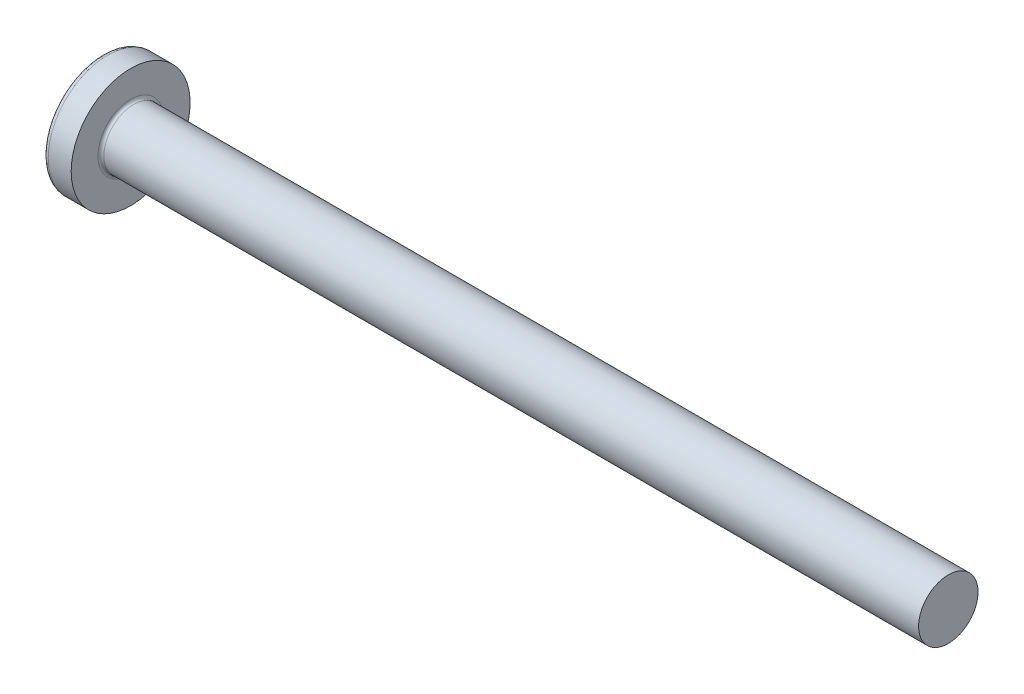
ISO-10303-21;
HEADER;
FILE_DESCRIPTION(('STEP AP214'),'2;1');
FILE_NAME('part.step','',(''),(''),'','','');
FILE_SCHEMA(('AUTOMOTIVE_DESIGN { 1 0 10303 214 1 1 1 1 }'));
ENDSEC;
DATA;
#1=APPLICATION_CONTEXT('core data for automotive mechanical design processes');
#2=APPLICATION_PROTOCOL_DEFINITION('international standard','automotive_design',2000,#1);
#3=PRODUCT_CONTEXT('',#1,'mechanical');
#4=PRODUCT('Part','Part','',(#3));
#5=PRODUCT_RELATED_PRODUCT_CATEGORY('part','',(#4));
#6=PRODUCT_DEFINITION_FORMATION('','',#4);
#7=PRODUCT_DEFINITION_CONTEXT('part definition',#1,'design');
#8=PRODUCT_DEFINITION('design','',#6,#7);
#9=PRODUCT_DEFINITION_SHAPE('','',#8);
#10=(LENGTH_UNIT() NAMED_UNIT(*) SI_UNIT(.MILLI.,.METRE.));
#11=(NAMED_UNIT(*) PLANE_ANGLE_UNIT() SI_UNIT($,.RADIAN.));
#12=(NAMED_UNIT(*) SI_UNIT($,.STERADIAN.) SOLID_ANGLE_UNIT());
#13=UNCERTAINTY_MEASURE_WITH_UNIT(LENGTH_MEASURE(1.E-05),#10,'distance_accuracy_value','');
#14=(GEOMETRIC_REPRESENTATION_CONTEXT(3) GLOBAL_UNCERTAINTY_ASSIGNED_CONTEXT((#13)) GLOBAL_UNIT_ASSIGNED_CONTEXT((#10,
#11,#12)) REPRESENTATION_CONTEXT('',''));
#15=CARTESIAN_POINT('',(0.,0.,0.));
#16=DIRECTION('',(0.,0.,1.));
#17=DIRECTION('',(1.,0.,0.));
#18=AXIS2_PLACEMENT_3D('',#15,#16,#17);
#19=CARTESIAN_POINT('',(6.5,0.,0.));
#20=DIRECTION('',(-1.,0.,0.));
#21=DIRECTION('',(0.,1.,0.));
#22=AXIS2_PLACEMENT_3D('',#19,#20,#21);
#23=SPHERICAL_SURFACE('',#22,6.5);
#24=CARTESIAN_POINT('',(1.26538895452803,0.,0.));
#25=DIRECTION('',(-1.,0.,0.));
#26=DIRECTION('',(0.,0.,1.));
#27=AXIS2_PLACEMENT_3D('',#24,#25,#26);
#28=CIRCLE('',#27,3.85342019543974);
#29=CARTESIAN_POINT('',(1.26538895452803,0.,3.85342019543974));
#30=VERTEX_POINT('',#29);
#31=EDGE_CURVE('E222',#30,#30,#28,.T.);
#32=ORIENTED_EDGE('',*,*,#31,.T.);
#33=EDGE_LOOP('',(#32));
#34=FACE_BOUND('',#33,.T.);
#35=CARTESIAN_POINT('',(0.0788099820016241,0.,0.));
#36=DIRECTION('',(1.,0.,0.));
#37=DIRECTION('',(0.,0.,-1.));
#38=AXIS2_PLACEMENT_3D('',#35,#36,#37);
#39=CIRCLE('',#38,1.0091178091571);
#40=CARTESIAN_POINT('',(0.0788099820016233,-0.514999999999997,-0.867809744562728));
#41=VERTEX_POINT('',#40);
#42=CARTESIAN_POINT('',(0.0788099820016245,-0.867809744562729,-0.515));
#43=VERTEX_POINT('',#42);
#44=EDGE_CURVE('E381',#41,#43,#39,.F.);
#45=ORIENTED_EDGE('',*,*,#44,.F.);
#46=CARTESIAN_POINT('',(6.5,-0.515,0.));
#47=DIRECTION('',(0.,1.,0.));
#48=DIRECTION('',(0.,0.,1.));
#49=AXIS2_PLACEMENT_3D('',#46,#47,#48);
#50=CIRCLE('',#49,6.47956595768575);
#51=CARTESIAN_POINT('',(0.331830520157853,-0.514999999999993,-1.98455543332603));
#52=VERTEX_POINT('',#51);
#53=EDGE_CURVE('E297',#52,#41,#50,.T.);
#54=ORIENTED_EDGE('',*,*,#53,.F.);
#55=CARTESIAN_POINT('',(6.06443225879603,0.,0.873613881878153));
#56=DIRECTION('',(0.446197753347436,0.,-0.894934391398443));
#57=DIRECTION('',(-0.894934391398442,0.,-0.446197753347436));
#58=AXIS2_PLACEMENT_3D('',#55,#56,#57);
#59=CIRCLE('',#58,6.42628038045433);
#60=CARTESIAN_POINT('',(0.331830520157853,0.515000000000007,-1.98455543332603));
#61=VERTEX_POINT('',#60);
#62=EDGE_CURVE('E266',#52,#61,#59,.T.);
#63=ORIENTED_EDGE('',*,*,#62,.T.);
#64=CARTESIAN_POINT('',(6.5,0.515,0.));
#65=DIRECTION('',(0.,-1.,0.));
#66=DIRECTION('',(0.,0.,-1.));
#67=AXIS2_PLACEMENT_3D('',#64,#65,#66);
#68=CIRCLE('',#67,6.47956595768575);
#69=CARTESIAN_POINT('',(0.0788099820016234,0.515000000000003,-0.867809744562724));
#70=VERTEX_POINT('',#69);
#71=EDGE_CURVE('E333',#70,#61,#68,.T.);
#72=ORIENTED_EDGE('',*,*,#71,.F.);
#73=CARTESIAN_POINT('',(0.0788099820016245,0.86780974456273,-0.515));
#74=VERTEX_POINT('',#73);
#75=EDGE_CURVE('E402',#74,#70,#39,.F.);
#76=ORIENTED_EDGE('',*,*,#75,.F.);
#77=CARTESIAN_POINT('',(6.5,0.,-0.515));
#78=DIRECTION('',(0.,0.,1.));
#79=DIRECTION('',(1.,0.,0.));
#80=AXIS2_PLACEMENT_3D('',#77,#78,#79);
#81=CIRCLE('',#80,6.47956595768575);
#82=CARTESIAN_POINT('',(0.331830520157854,1.98455543332603,-0.515));
#83=VERTEX_POINT('',#82);
#84=EDGE_CURVE('E258',#83,#74,#81,.T.);
#85=ORIENTED_EDGE('',*,*,#84,.F.);
#86=CARTESIAN_POINT('',(6.06443225879603,-0.873613881878153,0.));
#87=DIRECTION('',(0.446197753347436,0.894934391398443,0.));
#88=DIRECTION('',(-0.894934391398442,0.446197753347436,0.));
#89=AXIS2_PLACEMENT_3D('',#86,#87,#88);
#90=CIRCLE('',#89,6.42628038045433);
#91=CARTESIAN_POINT('',(0.331830520157854,1.98455543332603,0.515));
#92=VERTEX_POINT('',#91);
#93=EDGE_CURVE('E262',#83,#92,#90,.T.);
#94=ORIENTED_EDGE('',*,*,#93,.T.);
#95=CARTESIAN_POINT('',(6.5,0.,0.515));
#96=DIRECTION('',(0.,0.,-1.));
#97=DIRECTION('',(0.,1.,0.));
#98=AXIS2_PLACEMENT_3D('',#95,#96,#97);
#99=CIRCLE('',#98,6.47956595768575);
#100=CARTESIAN_POINT('',(0.0788099820016245,0.86780974456273,0.515));
#101=VERTEX_POINT('',#100);
#102=EDGE_CURVE('E253',#101,#92,#99,.T.);
#103=ORIENTED_EDGE('',*,*,#102,.F.);
#104=CARTESIAN_POINT('',(0.0788099820016232,0.514999999999997,0.867809744562728));
#105=VERTEX_POINT('',#104);
#106=EDGE_CURVE('E401',#105,#101,#39,.F.);
#107=ORIENTED_EDGE('',*,*,#106,.F.);
#108=CARTESIAN_POINT('',(0.331830520157854,0.514999999999993,1.98455543332604));
#109=VERTEX_POINT('',#108);
#110=EDGE_CURVE('E278',#109,#105,#68,.T.);
#111=ORIENTED_EDGE('',*,*,#110,.F.);
#112=CARTESIAN_POINT('',(6.06443225879603,0.,-0.873613881878153));
#113=DIRECTION('',(0.446197753347436,0.,0.894934391398443));
#114=DIRECTION('',(0.894934391398442,0.,-0.446197753347436));
#115=AXIS2_PLACEMENT_3D('',#112,#113,#114);
#116=CIRCLE('',#115,6.42628038045433);
#117=CARTESIAN_POINT('',(0.331830520157854,-0.515000000000007,1.98455543332603));
#118=VERTEX_POINT('',#117);
#119=EDGE_CURVE('E56',#109,#118,#116,.T.);
#120=ORIENTED_EDGE('',*,*,#119,.T.);
#121=CARTESIAN_POINT('',(0.0788099820016234,-0.515000000000003,0.867809744562724));
#122=VERTEX_POINT('',#121);
#123=EDGE_CURVE('E275',#122,#118,#50,.T.);
#124=ORIENTED_EDGE('',*,*,#123,.F.);
#125=CARTESIAN_POINT('',(0.0788099820016245,-0.867809744562729,0.515));
#126=VERTEX_POINT('',#125);
#127=EDGE_CURVE('E440',#126,#122,#39,.F.);
#128=ORIENTED_EDGE('',*,*,#127,.F.);
#129=CARTESIAN_POINT('',(0.331830520157854,-1.98455543332603,0.515));
#130=VERTEX_POINT('',#129);
#131=EDGE_CURVE('E254',#130,#126,#99,.T.);
#132=ORIENTED_EDGE('',*,*,#131,.F.);
#133=CARTESIAN_POINT('',(6.06443225879604,0.873613881878153,0.));
#134=DIRECTION('',(0.446197753347436,-0.894934391398443,0.));
#135=DIRECTION('',(0.894934391398442,0.446197753347436,0.));
#136=AXIS2_PLACEMENT_3D('',#133,#134,#135);
#137=CIRCLE('',#136,6.42628038045433);
#138=CARTESIAN_POINT('',(0.331830520157854,-1.98455543332603,-0.515));
#139=VERTEX_POINT('',#138);
#140=EDGE_CURVE('E249',#130,#139,#137,.T.);
#141=ORIENTED_EDGE('',*,*,#140,.T.);
#142=EDGE_CURVE('E71',#43,#139,#81,.T.);
#143=ORIENTED_EDGE('',*,*,#142,.F.);
#144=EDGE_LOOP('',(#45,#54,#63,#72,#76,#85,#94,#103,#107,#111,#120,#124,#128,#132,#141,#143));
#145=FACE_BOUND('',#144,.T.);
#146=ADVANCED_FACE('F41',(#34,#145),#23,.T.);
#147=CARTESIAN_POINT('',(0.,2.15,-0.515));
#148=DIRECTION('',(0.,0.,1.));
#149=DIRECTION('',(1.,0.,0.));
#150=AXIS2_PLACEMENT_3D('',#147,#148,#149);
#151=PLANE('',#150);
#152=ORIENTED_EDGE('',*,*,#84,.T.);
#153=CARTESIAN_POINT('',(-1.51195208675156,0.994972220320188,-0.515));
#154=CARTESIAN_POINT('',(-1.2040598194928,0.970722016949958,-0.515));
#155=CARTESIAN_POINT('',(-0.896180907521175,0.946299109919651,-0.515));
#156=CARTESIAN_POINT('',(-0.280449079832186,0.896981122427851,-0.515));
#157=CARTESIAN_POINT('',(0.0274038344396859,0.872086023934883,-0.515));
#158=CARTESIAN_POINT('',(0.48914673951535,0.83429553519528,-0.515));
#159=CARTESIAN_POINT('',(0.643055047553845,0.821624058404092,-0.515));
#160=CARTESIAN_POINT('',(0.950856520197139,0.796108332639504,-0.515));
#161=CARTESIAN_POINT('',(1.10474968487868,0.783264084592466,-0.515));
#162=CARTESIAN_POINT('',(1.41251352095103,0.757376569093378,-0.515));
#163=CARTESIAN_POINT('',(1.56638419296577,0.744333309065218,-0.515));
#164=CARTESIAN_POINT('',(1.87410847343335,0.718013273188896,-0.515));
#165=CARTESIAN_POINT('',(2.02796208151372,0.704736492982792,-0.515));
#166=CARTESIAN_POINT('',(2.36455311890989,0.675386943006726,-0.515));
#167=CARTESIAN_POINT('',(2.54728562293342,0.659257575640986,-0.515));
#168=CARTESIAN_POINT('',(2.91270624109256,0.626517182479888,-0.515));
#169=CARTESIAN_POINT('',(3.09539435554038,0.609906160177238,-0.515));
#170=CARTESIAN_POINT('',(3.46069832191613,0.576073027116421,-0.515));
#171=CARTESIAN_POINT('',(3.64331417870068,0.558850968932727,-0.515));
#172=CARTESIAN_POINT('',(4.00847437496567,0.523604864540037,-0.515));
#173=CARTESIAN_POINT('',(4.19101871216888,0.505580794604253,-0.515));
#174=CARTESIAN_POINT('',(4.55606208157937,0.468429191666488,-0.515));
#175=CARTESIAN_POINT('',(4.73856107358023,0.449301262281853,-0.515));
#176=CARTESIAN_POINT('',(5.10337547353419,0.409473604748924,-0.515));
#177=CARTESIAN_POINT('',(5.28569089526422,0.388774005106069,-0.515));
#178=CARTESIAN_POINT('',(5.55897278495412,0.355828287527264,-0.515));
#179=CARTESIAN_POINT('',(5.65005277419686,0.344527918782738,-0.515));
#180=CARTESIAN_POINT('',(5.83209904103608,0.321075174263031,-0.515));
#181=CARTESIAN_POINT('',(5.92306532397915,0.308922840209686,-0.515));
#182=CARTESIAN_POINT('',(6.10486078872898,0.28342733445193,-0.515));
#183=CARTESIAN_POINT('',(6.1956899229938,0.270083817601714,-0.515));
#184=CARTESIAN_POINT('',(6.33172773785679,0.248701420809951,-0.515));
#185=CARTESIAN_POINT('',(6.37704304473344,0.241345446705304,-0.515));
#186=CARTESIAN_POINT('',(6.4675722520141,0.226018953559338,-0.515));
#187=CARTESIAN_POINT('',(6.51278614568083,0.218048394864476,-0.515));
#188=CARTESIAN_POINT('',(6.55793125759549,0.209691465274944,-0.515));
#189=B_SPLINE_CURVE_WITH_KNOTS('',3,(#153,#154,#155,#156,#157,#158,#159,#160,#161,#162,#163,
#164,#165,#166,#167,#168,#169,#170,#171,#172,#173,#174,#175,#176,#177,#178,#179,#180,#181,#182,
#183,#184,#185,#186,#187,#188),.UNSPECIFIED.,.F.,.F.,(4,2,2,2,2,2,2,2,2,2,2,2,2,2,2,2,2,4),(0.,
0.926537709781721,1.85311087258339,2.31639796016285,2.77968256468771,3.24294992902055,
3.70622594801777,4.25655436065378,4.80687878359543,5.35715597005738,5.90744944680718,
6.45794177197673,7.008389135274,7.28372117336899,7.55903973750591,7.83443833587749,
7.97216007460855,8.10989070671571),.UNSPECIFIED.);
#190=CARTESIAN_POINT('',(2.34,0.677477674908923,-0.515));
#191=VERTEX_POINT('',#190);
#192=EDGE_CURVE('E425',#74,#191,#189,.T.);
#193=ORIENTED_EDGE('',*,*,#192,.T.);
#194=DIRECTION('',(0.,1.,0.));
#195=VECTOR('',#194,1.);
#196=CARTESIAN_POINT('',(2.34,-0.983319232260742,-0.515));
#197=LINE('',#196,#195);
#198=CARTESIAN_POINT('',(2.34,0.983319232260743,-0.515));
#199=VERTEX_POINT('',#198);
#200=EDGE_CURVE('E362',#191,#199,#197,.T.);
#201=ORIENTED_EDGE('',*,*,#200,.T.);
#202=DIRECTION('',(0.894934391398442,-0.446197753347436,0.));
#203=VECTOR('',#202,1.);
#204=CARTESIAN_POINT('',(0.,2.15,-0.515));
#205=LINE('',#204,#203);
#206=EDGE_CURVE('E223',#83,#199,#205,.T.);
#207=ORIENTED_EDGE('',*,*,#206,.F.);
#208=EDGE_LOOP('',(#152,#193,#201,#207));
#209=FACE_BOUND('',#208,.T.);
#210=ADVANCED_FACE('F177',(#209),#151,.T.);
#211=CARTESIAN_POINT('',(2.34,-0.983319232260742,-0.515));
#212=VERTEX_POINT('',#211);
#213=CARTESIAN_POINT('',(2.34,-0.677477674908923,-0.515));
#214=VERTEX_POINT('',#213);
#215=EDGE_CURVE('E233',#212,#214,#197,.T.);
#216=ORIENTED_EDGE('',*,*,#215,.T.);
#217=CARTESIAN_POINT('',(-1.51195208675156,-0.994972220320188,-0.515));
#218=CARTESIAN_POINT('',(-1.2040598194928,-0.970722016949958,-0.515));
#219=CARTESIAN_POINT('',(-0.896180907521175,-0.946299109919651,-0.515));
#220=CARTESIAN_POINT('',(-0.280449079832186,-0.896981122427851,-0.515));
#221=CARTESIAN_POINT('',(0.0274038344396859,-0.872086023934883,-0.515));
#222=CARTESIAN_POINT('',(0.489146739515349,-0.83429553519528,-0.515));
#223=CARTESIAN_POINT('',(0.643055047553845,-0.821624058404092,-0.515));
#224=CARTESIAN_POINT('',(0.950856520197139,-0.796108332639504,-0.515));
#225=CARTESIAN_POINT('',(1.10474968487868,-0.783264084592466,-0.515));
#226=CARTESIAN_POINT('',(1.41251352095103,-0.757376569093378,-0.515));
#227=CARTESIAN_POINT('',(1.56638419296577,-0.744333309065218,-0.515));
#228=CARTESIAN_POINT('',(1.87410847343335,-0.718013273188896,-0.515));
#229=CARTESIAN_POINT('',(2.02796208151372,-0.704736492982792,-0.515));
#230=CARTESIAN_POINT('',(2.36455311890989,-0.675386943006726,-0.515));
#231=CARTESIAN_POINT('',(2.54728562293342,-0.659257575640986,-0.515));
#232=CARTESIAN_POINT('',(2.91270624109256,-0.626517182479888,-0.515));
#233=CARTESIAN_POINT('',(3.09539435554038,-0.609906160177238,-0.515));
#234=CARTESIAN_POINT('',(3.46069832191613,-0.576073027116421,-0.515));
#235=CARTESIAN_POINT('',(3.64331417870068,-0.558850968932727,-0.515));
#236=CARTESIAN_POINT('',(4.00847437496567,-0.523604864540037,-0.515));
#237=CARTESIAN_POINT('',(4.19101871216888,-0.505580794604253,-0.515));
#238=CARTESIAN_POINT('',(4.55606208157937,-0.468429191666488,-0.515));
#239=CARTESIAN_POINT('',(4.73856107358023,-0.449301262281853,-0.515));
#240=CARTESIAN_POINT('',(5.10337547353419,-0.409473604748924,-0.515));
#241=CARTESIAN_POINT('',(5.28569089526422,-0.388774005106069,-0.515));
#242=CARTESIAN_POINT('',(5.55897278495412,-0.355828287527264,-0.515));
#243=CARTESIAN_POINT('',(5.65005277419686,-0.344527918782738,-0.515));
#244=CARTESIAN_POINT('',(5.83209904103608,-0.321075174263031,-0.515));
#245=CARTESIAN_POINT('',(5.92306532397915,-0.308922840209686,-0.515));
#246=CARTESIAN_POINT('',(6.10486078872898,-0.28342733445193,-0.515));
#247=CARTESIAN_POINT('',(6.1956899229938,-0.270083817601714,-0.515));
#248=CARTESIAN_POINT('',(6.3317277378568,-0.24870142080995,-0.515));
#249=CARTESIAN_POINT('',(6.37704304473344,-0.241345446705304,-0.515));
#250=CARTESIAN_POINT('',(6.4675722520141,-0.226018953559337,-0.515));
#251=CARTESIAN_POINT('',(6.51278614568083,-0.218048394864476,-0.515));
#252=CARTESIAN_POINT('',(6.55793125759549,-0.209691465274944,-0.515));
#253=B_SPLINE_CURVE_WITH_KNOTS('',3,(#217,#218,#219,#220,#221,#222,#223,#224,#225,#226,#227,
#228,#229,#230,#231,#232,#233,#234,#235,#236,#237,#238,#239,#240,#241,#242,#243,#244,#245,#246,
#247,#248,#249,#250,#251,#252),.UNSPECIFIED.,.F.,.F.,(4,2,2,2,2,2,2,2,2,2,2,2,2,2,2,2,2,4),(0.,
0.926537709781721,1.85311087258339,2.31639796016285,2.77968256468771,3.24294992902055,
3.70622594801777,4.25655436065378,4.80687878359543,5.35715597005738,5.90744944680718,
6.45794177197674,7.008389135274,7.28372117336899,7.55903973750591,7.83443833587749,
7.97216007460855,8.10989070671572),.UNSPECIFIED.);
#254=EDGE_CURVE('E400',#214,#43,#253,.F.);
#255=ORIENTED_EDGE('',*,*,#254,.T.);
#256=ORIENTED_EDGE('',*,*,#142,.T.);
#257=DIRECTION('',(0.894934391398442,0.446197753347436,0.));
#258=VECTOR('',#257,1.);
#259=CARTESIAN_POINT('',(0.,-2.15,-0.515));
#260=LINE('',#259,#258);
#261=EDGE_CURVE('E337',#139,#212,#260,.T.);
#262=ORIENTED_EDGE('',*,*,#261,.T.);
#263=EDGE_LOOP('',(#216,#255,#256,#262));
#264=FACE_BOUND('',#263,.T.);
#265=ADVANCED_FACE('F183',(#264),#151,.T.);
#266=CARTESIAN_POINT('',(0.,-2.15,0.515));
#267=DIRECTION('',(0.,0.,-1.));
#268=DIRECTION('',(0.,1.,0.));
#269=AXIS2_PLACEMENT_3D('',#266,#267,#268);
#270=PLANE('',#269);
#271=DIRECTION('',(0.,-1.,0.));
#272=VECTOR('',#271,1.);
#273=CARTESIAN_POINT('',(2.34,0.983319232260742,0.515));
#274=LINE('',#273,#272);
#275=CARTESIAN_POINT('',(2.34,0.983319232260743,0.515));
#276=VERTEX_POINT('',#275);
#277=CARTESIAN_POINT('',(2.34,0.677477674908923,0.515));
#278=VERTEX_POINT('',#277);
#279=EDGE_CURVE('E348',#276,#278,#274,.T.);
#280=ORIENTED_EDGE('',*,*,#279,.T.);
#281=CARTESIAN_POINT('',(-1.51195208675156,0.994972220320187,0.515));
#282=CARTESIAN_POINT('',(-1.2040598194928,0.970722016949958,0.515));
#283=CARTESIAN_POINT('',(-0.896180907521175,0.946299109919651,0.515));
#284=CARTESIAN_POINT('',(-0.280449079832187,0.896981122427851,0.515));
#285=CARTESIAN_POINT('',(0.0274038344396859,0.872086023934883,0.515));
#286=CARTESIAN_POINT('',(0.489146739515349,0.83429553519528,0.515));
#287=CARTESIAN_POINT('',(0.643055047553845,0.821624058404092,0.515));
#288=CARTESIAN_POINT('',(0.950856520197139,0.796108332639504,0.515));
#289=CARTESIAN_POINT('',(1.10474968487868,0.783264084592466,0.515));
#290=CARTESIAN_POINT('',(1.41251352095103,0.757376569093378,0.515));
#291=CARTESIAN_POINT('',(1.56638419296577,0.744333309065218,0.515));
#292=CARTESIAN_POINT('',(1.87410847343335,0.718013273188896,0.515));
#293=CARTESIAN_POINT('',(2.02796208151372,0.704736492982792,0.515));
#294=CARTESIAN_POINT('',(2.36455311890989,0.675386943006726,0.515));
#295=CARTESIAN_POINT('',(2.54728562293342,0.659257575640986,0.515));
#296=CARTESIAN_POINT('',(2.91270624109256,0.626517182479888,0.515));
#297=CARTESIAN_POINT('',(3.09539435554038,0.609906160177238,0.515));
#298=CARTESIAN_POINT('',(3.46069832191612,0.576073027116421,0.515));
#299=CARTESIAN_POINT('',(3.64331417870068,0.558850968932727,0.515));
#300=CARTESIAN_POINT('',(4.00847437496567,0.523604864540037,0.515));
#301=CARTESIAN_POINT('',(4.19101871216888,0.505580794604253,0.515));
#302=CARTESIAN_POINT('',(4.55606208157937,0.468429191666488,0.515));
#303=CARTESIAN_POINT('',(4.73856107358022,0.449301262281854,0.515));
#304=CARTESIAN_POINT('',(5.10337547353418,0.409473604748925,0.515));
#305=CARTESIAN_POINT('',(5.28569089526422,0.38877400510607,0.515));
#306=CARTESIAN_POINT('',(5.55897278495412,0.355828287527264,0.515));
#307=CARTESIAN_POINT('',(5.65005277419686,0.344527918782739,0.515));
#308=CARTESIAN_POINT('',(5.83209904103607,0.321075174263031,0.515));
#309=CARTESIAN_POINT('',(5.92306532397915,0.308922840209686,0.515));
#310=CARTESIAN_POINT('',(6.10486078872898,0.28342733445193,0.515));
#311=CARTESIAN_POINT('',(6.1956899229938,0.270083817601714,0.515));
#312=CARTESIAN_POINT('',(6.33172773785679,0.248701420809951,0.515));
#313=CARTESIAN_POINT('',(6.37704304473344,0.241345446705304,0.515));
#314=CARTESIAN_POINT('',(6.4675722520141,0.226018953559338,0.515));
#315=CARTESIAN_POINT('',(6.51278614568083,0.218048394864476,0.515));
#316=CARTESIAN_POINT('',(6.55793125759549,0.209691465274945,0.515));
#317=B_SPLINE_CURVE_WITH_KNOTS('',3,(#281,#282,#283,#284,#285,#286,#287,#288,#289,#290,#291,
#292,#293,#294,#295,#296,#297,#298,#299,#300,#301,#302,#303,#304,#305,#306,#307,#308,#309,#310,
#311,#312,#313,#314,#315,#316),.UNSPECIFIED.,.F.,.F.,(4,2,2,2,2,2,2,2,2,2,2,2,2,2,2,2,2,4),(0.,
0.926537709781721,1.85311087258339,2.31639796016285,2.77968256468771,3.24294992902055,
3.70622594801777,4.25655436065378,4.80687878359543,5.35715597005738,5.90744944680718,
6.45794177197673,7.008389135274,7.28372117336899,7.55903973750591,7.83443833587749,
7.97216007460855,8.10989070671571),.UNSPECIFIED.);
#318=EDGE_CURVE('E302',#278,#101,#317,.F.);
#319=ORIENTED_EDGE('',*,*,#318,.T.);
#320=ORIENTED_EDGE('',*,*,#102,.T.);
#321=DIRECTION('',(0.894934391398442,-0.446197753347436,0.));
#322=VECTOR('',#321,1.);
#323=CARTESIAN_POINT('',(0.,2.15,0.515));
#324=LINE('',#323,#322);
#325=EDGE_CURVE('E230',#92,#276,#324,.T.);
#326=ORIENTED_EDGE('',*,*,#325,.T.);
#327=EDGE_LOOP('',(#280,#319,#320,#326));
#328=FACE_BOUND('',#327,.T.);
#329=ADVANCED_FACE('F421',(#328),#270,.T.);
#330=ORIENTED_EDGE('',*,*,#131,.T.);
#331=CARTESIAN_POINT('',(-1.51195208675156,-0.994972220320188,0.515));
#332=CARTESIAN_POINT('',(-1.2040598194928,-0.970722016949958,0.515));
#333=CARTESIAN_POINT('',(-0.896180907521175,-0.946299109919651,0.515));
#334=CARTESIAN_POINT('',(-0.280449079832186,-0.896981122427852,0.515));
#335=CARTESIAN_POINT('',(0.0274038344396859,-0.872086023934883,0.515));
#336=CARTESIAN_POINT('',(0.48914673951535,-0.83429553519528,0.515));
#337=CARTESIAN_POINT('',(0.643055047553845,-0.821624058404092,0.515));
#338=CARTESIAN_POINT('',(0.950856520197139,-0.796108332639504,0.515));
#339=CARTESIAN_POINT('',(1.10474968487868,-0.783264084592466,0.515));
#340=CARTESIAN_POINT('',(1.41251352095103,-0.757376569093379,0.515));
#341=CARTESIAN_POINT('',(1.56638419296577,-0.744333309065218,0.515));
#342=CARTESIAN_POINT('',(1.87410847343335,-0.718013273188896,0.515));
#343=CARTESIAN_POINT('',(2.02796208151372,-0.704736492982792,0.515));
#344=CARTESIAN_POINT('',(2.36455311890989,-0.675386943006726,0.515));
#345=CARTESIAN_POINT('',(2.54728562293342,-0.659257575640986,0.515));
#346=CARTESIAN_POINT('',(2.91270624109256,-0.626517182479888,0.515));
#347=CARTESIAN_POINT('',(3.09539435554038,-0.609906160177238,0.515));
#348=CARTESIAN_POINT('',(3.46069832191613,-0.576073027116422,0.515));
#349=CARTESIAN_POINT('',(3.64331417870068,-0.558850968932728,0.515));
#350=CARTESIAN_POINT('',(4.00847437496567,-0.523604864540037,0.515));
#351=CARTESIAN_POINT('',(4.19101871216888,-0.505580794604253,0.515));
#352=CARTESIAN_POINT('',(4.55606208157937,-0.468429191666488,0.515));
#353=CARTESIAN_POINT('',(4.73856107358023,-0.449301262281854,0.515));
#354=CARTESIAN_POINT('',(5.10337547353419,-0.409473604748924,0.515));
#355=CARTESIAN_POINT('',(5.28569089526422,-0.38877400510607,0.515));
#356=CARTESIAN_POINT('',(5.55897278495412,-0.355828287527264,0.515));
#357=CARTESIAN_POINT('',(5.65005277419686,-0.344527918782739,0.515));
#358=CARTESIAN_POINT('',(5.83209904103608,-0.321075174263031,0.515));
#359=CARTESIAN_POINT('',(5.92306532397915,-0.308922840209686,0.515));
#360=CARTESIAN_POINT('',(6.10486078872898,-0.28342733445193,0.515));
#361=CARTESIAN_POINT('',(6.1956899229938,-0.270083817601714,0.515));
#362=CARTESIAN_POINT('',(6.33172773785679,-0.248701420809951,0.515));
#363=CARTESIAN_POINT('',(6.37704304473344,-0.241345446705304,0.515));
#364=CARTESIAN_POINT('',(6.4675722520141,-0.226018953559338,0.515));
#365=CARTESIAN_POINT('',(6.51278614568083,-0.218048394864477,0.515));
#366=CARTESIAN_POINT('',(6.55793125759549,-0.209691465274945,0.515));
#367=B_SPLINE_CURVE_WITH_KNOTS('',3,(#331,#332,#333,#334,#335,#336,#337,#338,#339,#340,#341,
#342,#343,#344,#345,#346,#347,#348,#349,#350,#351,#352,#353,#354,#355,#356,#357,#358,#359,#360,
#361,#362,#363,#364,#365,#366),.UNSPECIFIED.,.F.,.F.,(4,2,2,2,2,2,2,2,2,2,2,2,2,2,2,2,2,4),(0.,
0.926537709781721,1.85311087258339,2.31639796016285,2.77968256468771,3.24294992902055,
3.70622594801777,4.25655436065378,4.80687878359543,5.35715597005738,5.90744944680718,
6.45794177197673,7.008389135274,7.28372117336899,7.55903973750591,7.83443833587749,
7.97216007460855,8.10989070671571),.UNSPECIFIED.);
#368=CARTESIAN_POINT('',(2.34,-0.677477674908923,0.515));
#369=VERTEX_POINT('',#368);
#370=EDGE_CURVE('E441',#126,#369,#367,.T.);
#371=ORIENTED_EDGE('',*,*,#370,.T.);
#372=CARTESIAN_POINT('',(2.34,-0.983319232260742,0.515));
#373=VERTEX_POINT('',#372);
#374=EDGE_CURVE('E351',#369,#373,#274,.T.);
#375=ORIENTED_EDGE('',*,*,#374,.T.);
#376=DIRECTION('',(0.894934391398442,0.446197753347436,0.));
#377=VECTOR('',#376,1.);
#378=CARTESIAN_POINT('',(0.,-2.15,0.515));
#379=LINE('',#378,#377);
#380=EDGE_CURVE('E340',#130,#373,#379,.T.);
#381=ORIENTED_EDGE('',*,*,#380,.F.);
#382=EDGE_LOOP('',(#330,#371,#375,#381));
#383=FACE_BOUND('',#382,.T.);
#384=ADVANCED_FACE('F471',(#383),#270,.T.);
#385=CARTESIAN_POINT('',(2.34,0.983319232260742,-0.515));
#386=DIRECTION('',(-1.,0.,0.));
#387=DIRECTION('',(0.,0.,1.));
#388=AXIS2_PLACEMENT_3D('',#385,#386,#387);
#389=PLANE('',#388);
#390=ORIENTED_EDGE('',*,*,#374,.F.);
#391=CARTESIAN_POINT('',(2.34,0.,0.));
#392=DIRECTION('',(-1.,0.,0.));
#393=DIRECTION('',(0.,0.,1.));
#394=AXIS2_PLACEMENT_3D('',#391,#392,#393);
#395=CIRCLE('',#394,0.851);
#396=EDGE_CURVE('E393',#214,#369,#395,.T.);
#397=ORIENTED_EDGE('',*,*,#396,.F.);
#398=ORIENTED_EDGE('',*,*,#215,.F.);
#399=DIRECTION('',(0.,0.,1.));
#400=VECTOR('',#399,1.);
#401=CARTESIAN_POINT('',(2.34,-0.983319232260742,-0.515));
#402=LINE('',#401,#400);
#403=EDGE_CURVE('E344',#212,#373,#402,.T.);
#404=ORIENTED_EDGE('',*,*,#403,.T.);
#405=EDGE_LOOP('',(#390,#397,#398,#404));
#406=FACE_BOUND('',#405,.T.);
#407=ADVANCED_FACE('F464',(#406),#389,.T.);
#408=DIRECTION('',(0.,0.,-1.));
#409=VECTOR('',#408,1.);
#410=CARTESIAN_POINT('',(2.34,-0.515000000000004,0.983319232260741));
#411=LINE('',#410,#409);
#412=CARTESIAN_POINT('',(2.34,-0.514999999999998,-0.677477674908925));
#413=VERTEX_POINT('',#412);
#414=CARTESIAN_POINT('',(2.34,-0.514999999999996,-0.983319232260744));
#415=VERTEX_POINT('',#414);
#416=EDGE_CURVE('E324',#413,#415,#411,.T.);
#417=ORIENTED_EDGE('',*,*,#416,.F.);
#418=CARTESIAN_POINT('',(2.34,0.515000000000002,-0.677477674908921));
#419=VERTEX_POINT('',#418);
#420=EDGE_CURVE('E63',#419,#413,#395,.T.);
#421=ORIENTED_EDGE('',*,*,#420,.F.);
#422=DIRECTION('',(0.,0.,1.));
#423=VECTOR('',#422,1.);
#424=CARTESIAN_POINT('',(2.34,0.515000000000004,-0.983319232260741));
#425=LINE('',#424,#423);
#426=CARTESIAN_POINT('',(2.34,0.515000000000004,-0.983319232260741));
#427=VERTEX_POINT('',#426);
#428=EDGE_CURVE('E328',#427,#419,#425,.T.);
#429=ORIENTED_EDGE('',*,*,#428,.F.);
#430=DIRECTION('',(0.,-1.,0.));
#431=VECTOR('',#430,1.);
#432=CARTESIAN_POINT('',(2.34,0.515000000000004,-0.983319232260741));
#433=LINE('',#432,#431);
#434=EDGE_CURVE('E316',#427,#415,#433,.T.);
#435=ORIENTED_EDGE('',*,*,#434,.T.);
#436=EDGE_LOOP('',(#417,#421,#429,#435));
#437=FACE_BOUND('',#436,.T.);
#438=ADVANCED_FACE('F385',(#437),#389,.T.);
#439=ORIENTED_EDGE('',*,*,#200,.F.);
#440=EDGE_CURVE('E392',#278,#191,#395,.T.);
#441=ORIENTED_EDGE('',*,*,#440,.F.);
#442=ORIENTED_EDGE('',*,*,#279,.F.);
#443=DIRECTION('',(0.,0.,-1.));
#444=VECTOR('',#443,1.);
#445=CARTESIAN_POINT('',(2.34,0.983319232260742,0.515));
#446=LINE('',#445,#444);
#447=EDGE_CURVE('E352',#276,#199,#446,.T.);
#448=ORIENTED_EDGE('',*,*,#447,.T.);
#449=EDGE_LOOP('',(#439,#441,#442,#448));
#450=FACE_BOUND('',#449,.T.);
#451=ADVANCED_FACE('F465',(#450),#389,.T.);
#452=CARTESIAN_POINT('',(0.,0.514999999999993,2.15));
#453=DIRECTION('',(0.,-1.,0.));
#454=DIRECTION('',(1.,0.,0.));
#455=AXIS2_PLACEMENT_3D('',#452,#453,#454);
#456=PLANE('',#455);
#457=ORIENTED_EDGE('',*,*,#110,.T.);
#458=CARTESIAN_POINT('',(-1.51195208754038,0.514999999999997,0.994972220382299));
#459=CARTESIAN_POINT('',(-1.20405982018868,0.514999999999997,0.970722017005066));
#460=CARTESIAN_POINT('',(-0.896180908124145,0.514999999999997,0.94629910996769));
#461=CARTESIAN_POINT('',(-0.280449080249314,0.514999999999997,0.896981122461529));
#462=CARTESIAN_POINT('',(0.0274038341154839,0.514999999999997,0.872086023961266));
#463=CARTESIAN_POINT('',(0.489146739371407,0.514999999999997,0.834295535207138));
#464=CARTESIAN_POINT('',(0.643055047497244,0.514999999999997,0.821624058408798));
#465=CARTESIAN_POINT('',(0.950856520315202,0.514999999999997,0.796108332629707));
#466=CARTESIAN_POINT('',(1.10474968508407,0.514999999999997,0.783264084575319));
#467=CARTESIAN_POINT('',(1.41251352133103,0.514999999999997,0.757376569061289));
#468=CARTESIAN_POINT('',(1.56638419343305,0.514999999999997,0.744333309025536));
#469=CARTESIAN_POINT('',(1.87410847407519,0.514999999999998,0.718013273133717));
#470=CARTESIAN_POINT('',(2.02796208224283,0.514999999999998,0.704736492919711));
#471=CARTESIAN_POINT('',(2.36455311972626,0.514999999999998,0.675386942934957));
#472=CARTESIAN_POINT('',(2.5472856237498,0.514999999999998,0.65925757556857));
#473=CARTESIAN_POINT('',(2.91270624190895,0.514999999999998,0.626517182406015));
#474=CARTESIAN_POINT('',(3.09539435635676,0.514999999999998,0.609906160102556));
#475=CARTESIAN_POINT('',(3.46069832273244,0.514999999999998,0.576073027039891));
#476=CARTESIAN_POINT('',(3.64331417951694,0.514999999999998,0.558850968855158));
#477=CARTESIAN_POINT('',(4.00847437578178,0.514999999999998,0.523604864460046));
#478=CARTESIAN_POINT('',(4.1910187129849,0.514999999999998,0.505580794522878));
#479=CARTESIAN_POINT('',(4.55606208239526,0.514999999999998,0.468429191581782));
#480=CARTESIAN_POINT('',(4.73856107439606,0.514999999999999,0.4493012621952));
#481=CARTESIAN_POINT('',(5.10337547434977,0.514999999999999,0.409473604657437));
#482=CARTESIAN_POINT('',(5.28569089607961,0.514999999999999,0.388774005011696));
#483=CARTESIAN_POINT('',(5.55897278576906,0.514999999999999,0.355828287427084));
#484=CARTESIAN_POINT('',(5.65005277501166,0.514999999999999,0.344527918680371));
#485=CARTESIAN_POINT('',(5.83209904185046,0.514999999999999,0.321075174155502));
#486=CARTESIAN_POINT('',(5.92306532479326,0.514999999999999,0.308922840099183));
#487=CARTESIAN_POINT('',(6.10486078954238,0.514999999999999,0.283427334334154));
#488=CARTESIAN_POINT('',(6.19568992380676,0.514999999999999,0.270083817479639));
#489=CARTESIAN_POINT('',(6.33172773866874,0.514999999999999,0.248701420679481));
#490=CARTESIAN_POINT('',(6.377043045545,0.514999999999999,0.241345446571709));
#491=CARTESIAN_POINT('',(6.46757225282465,0.514999999999999,0.226018953418426));
#492=CARTESIAN_POINT('',(6.51278614649077,0.514999999999999,0.218048394719371));
#493=CARTESIAN_POINT('',(6.55793125840465,0.514999999999999,0.209691465124903));
#494=B_SPLINE_CURVE_WITH_KNOTS('',3,(#458,#459,#460,#461,#462,#463,#464,#465,#466,#467,#468,
#469,#470,#471,#472,#473,#474,#475,#476,#477,#478,#479,#480,#481,#482,#483,#484,#485,#486,#487,
#488,#489,#490,#491,#492,#493),.UNSPECIFIED.,.F.,.F.,(4,2,2,2,2,2,2,2,2,2,2,2,2,2,2,2,2,4),(0.,
0.926537710061278,1.85311087314258,2.31639796098494,2.77968256577269,3.24294993036838,
3.70622594962848,4.2565543622647,4.80687878520654,5.3571559716686,5.90744944841855,
6.45794177358856,7.00838913688619,7.28372117498157,7.55903973911884,7.83443833749096,
7.97216007622236,8.10989070832989),.UNSPECIFIED.);
#495=CARTESIAN_POINT('',(2.34,0.514999999999998,0.677477674908924));
#496=VERTEX_POINT('',#495);
#497=EDGE_CURVE('E494',#105,#496,#494,.T.);
#498=ORIENTED_EDGE('',*,*,#497,.T.);
#499=CARTESIAN_POINT('',(2.34,0.514999999999997,0.983319232260744));
#500=VERTEX_POINT('',#499);
#501=EDGE_CURVE('E292',#496,#500,#425,.T.);
#502=ORIENTED_EDGE('',*,*,#501,.T.);
#503=DIRECTION('',(0.894934391398442,0.,-0.446197753347436));
#504=VECTOR('',#503,1.);
#505=CARTESIAN_POINT('',(0.,0.514999999999993,2.15));
#506=LINE('',#505,#504);
#507=EDGE_CURVE('E285',#109,#500,#506,.T.);
#508=ORIENTED_EDGE('',*,*,#507,.F.);
#509=EDGE_LOOP('',(#457,#498,#502,#508));
#510=FACE_BOUND('',#509,.T.);
#511=ADVANCED_FACE('F289',(#510),#456,.T.);
#512=CARTESIAN_POINT('',(0.,-0.514999999999992,-2.15));
#513=DIRECTION('',(0.,1.,0.));
#514=DIRECTION('',(0.,0.,1.));
#515=AXIS2_PLACEMENT_3D('',#512,#513,#514);
#516=PLANE('',#515);
#517=CARTESIAN_POINT('',(2.34,-0.515000000000004,0.983319232260741));
#518=VERTEX_POINT('',#517);
#519=CARTESIAN_POINT('',(2.34,-0.515000000000003,0.677477674908921));
#520=VERTEX_POINT('',#519);
#521=EDGE_CURVE('E320',#518,#520,#411,.T.);
#522=ORIENTED_EDGE('',*,*,#521,.T.);
#523=CARTESIAN_POINT('',(-1.51195208754038,-0.515000000000004,0.994972220382296));
#524=CARTESIAN_POINT('',(-1.20405982018868,-0.515000000000004,0.970722017005062));
#525=CARTESIAN_POINT('',(-0.896180908124145,-0.515000000000004,0.946299109967687));
#526=CARTESIAN_POINT('',(-0.280449080249314,-0.515000000000003,0.896981122461525));
#527=CARTESIAN_POINT('',(0.0274038341154835,-0.515000000000003,0.872086023961263));
#528=CARTESIAN_POINT('',(0.489146739371407,-0.515000000000003,0.834295535207134));
#529=CARTESIAN_POINT('',(0.643055047497243,-0.515000000000003,0.821624058408794));
#530=CARTESIAN_POINT('',(0.950856520315202,-0.515000000000003,0.796108332629704));
#531=CARTESIAN_POINT('',(1.10474968508407,-0.515000000000003,0.783264084575316));
#532=CARTESIAN_POINT('',(1.41251352133103,-0.515000000000003,0.757376569061286));
#533=CARTESIAN_POINT('',(1.56638419343305,-0.515000000000003,0.744333309025532));
#534=CARTESIAN_POINT('',(1.87410847407519,-0.515000000000003,0.718013273133714));
#535=CARTESIAN_POINT('',(2.02796208224282,-0.515000000000003,0.704736492919708));
#536=CARTESIAN_POINT('',(2.36455311972626,-0.515000000000002,0.675386942934954));
#537=CARTESIAN_POINT('',(2.5472856237498,-0.515000000000002,0.659257575568566));
#538=CARTESIAN_POINT('',(2.91270624190895,-0.515000000000002,0.626517182406012));
#539=CARTESIAN_POINT('',(3.09539435635676,-0.515000000000002,0.609906160102553));
#540=CARTESIAN_POINT('',(3.46069832273244,-0.515000000000002,0.576073027039887));
#541=CARTESIAN_POINT('',(3.64331417951694,-0.515000000000002,0.558850968855155));
#542=CARTESIAN_POINT('',(4.00847437578178,-0.515000000000002,0.523604864460042));
#543=CARTESIAN_POINT('',(4.1910187129849,-0.515000000000002,0.505580794522874));
#544=CARTESIAN_POINT('',(4.55606208239526,-0.515000000000002,0.468429191581778));
#545=CARTESIAN_POINT('',(4.73856107439606,-0.515000000000002,0.449301262195196));
#546=CARTESIAN_POINT('',(5.10337547434977,-0.515000000000001,0.409473604657433));
#547=CARTESIAN_POINT('',(5.28569089607961,-0.515000000000001,0.388774005011693));
#548=CARTESIAN_POINT('',(5.55897278576906,-0.515000000000001,0.355828287427081));
#549=CARTESIAN_POINT('',(5.65005277501166,-0.515000000000001,0.344527918680367));
#550=CARTESIAN_POINT('',(5.83209904185046,-0.515000000000001,0.321075174155498));
#551=CARTESIAN_POINT('',(5.92306532479326,-0.515000000000001,0.308922840099179));
#552=CARTESIAN_POINT('',(6.10486078954238,-0.515000000000001,0.283427334334151));
#553=CARTESIAN_POINT('',(6.19568992380676,-0.515000000000001,0.270083817479636));
#554=CARTESIAN_POINT('',(6.33172773866873,-0.515000000000001,0.248701420679478));
#555=CARTESIAN_POINT('',(6.37704304554499,-0.515000000000001,0.241345446571706));
#556=CARTESIAN_POINT('',(6.46757225282465,-0.515000000000001,0.226018953418422));
#557=CARTESIAN_POINT('',(6.51278614649077,-0.515000000000001,0.218048394719367));
#558=CARTESIAN_POINT('',(6.55793125840465,-0.515000000000001,0.2096914651249));
#559=B_SPLINE_CURVE_WITH_KNOTS('',3,(#523,#524,#525,#526,#527,#528,#529,#530,#531,#532,#533,
#534,#535,#536,#537,#538,#539,#540,#541,#542,#543,#544,#545,#546,#547,#548,#549,#550,#551,#552,
#553,#554,#555,#556,#557,#558),.UNSPECIFIED.,.F.,.F.,(4,2,2,2,2,2,2,2,2,2,2,2,2,2,2,2,2,4),(0.,
0.926537710061278,1.85311087314258,2.31639796098494,2.77968256577269,3.24294993036838,
3.70622594962848,4.2565543622647,4.80687878520654,5.3571559716686,5.90744944841855,
6.45794177358856,7.00838913688619,7.28372117498157,7.55903973911884,7.83443833749096,
7.97216007622236,8.10989070832989),.UNSPECIFIED.);
#560=EDGE_CURVE('E432',#520,#122,#559,.F.);
#561=ORIENTED_EDGE('',*,*,#560,.T.);
#562=ORIENTED_EDGE('',*,*,#123,.T.);
#563=DIRECTION('',(0.894934391398442,0.,-0.446197753347436));
#564=VECTOR('',#563,1.);
#565=CARTESIAN_POINT('',(0.,-0.515000000000008,2.15));
#566=LINE('',#565,#564);
#567=EDGE_CURVE('E287',#118,#518,#566,.T.);
#568=ORIENTED_EDGE('',*,*,#567,.T.);
#569=EDGE_LOOP('',(#522,#561,#562,#568));
#570=FACE_BOUND('',#569,.T.);
#571=ADVANCED_FACE('F212',(#570),#516,.T.);
#572=ORIENTED_EDGE('',*,*,#428,.T.);
#573=CARTESIAN_POINT('',(-1.51195208754038,0.515000000000004,-0.994972220382296));
#574=CARTESIAN_POINT('',(-1.20405982018868,0.515000000000003,-0.970722017005062));
#575=CARTESIAN_POINT('',(-0.896180908124145,0.515000000000003,-0.946299109967687));
#576=CARTESIAN_POINT('',(-0.280449080249314,0.515000000000003,-0.896981122461525));
#577=CARTESIAN_POINT('',(0.0274038341154835,0.515000000000003,-0.872086023961263));
#578=CARTESIAN_POINT('',(0.489146739371407,0.515000000000003,-0.834295535207134));
#579=CARTESIAN_POINT('',(0.643055047497243,0.515000000000003,-0.821624058408794));
#580=CARTESIAN_POINT('',(0.950856520315202,0.515000000000003,-0.796108332629704));
#581=CARTESIAN_POINT('',(1.10474968508407,0.515000000000003,-0.783264084575316));
#582=CARTESIAN_POINT('',(1.41251352133103,0.515000000000003,-0.757376569061286));
#583=CARTESIAN_POINT('',(1.56638419343305,0.515000000000003,-0.744333309025532));
#584=CARTESIAN_POINT('',(1.87410847407519,0.515000000000003,-0.718013273133714));
#585=CARTESIAN_POINT('',(2.02796208224282,0.515000000000002,-0.704736492919708));
#586=CARTESIAN_POINT('',(2.36455311972626,0.515000000000002,-0.675386942934954));
#587=CARTESIAN_POINT('',(2.5472856237498,0.515000000000002,-0.659257575568566));
#588=CARTESIAN_POINT('',(2.91270624190895,0.515000000000002,-0.626517182406012));
#589=CARTESIAN_POINT('',(3.09539435635676,0.515000000000002,-0.609906160102553));
#590=CARTESIAN_POINT('',(3.46069832273244,0.515000000000002,-0.576073027039887));
#591=CARTESIAN_POINT('',(3.64331417951694,0.515000000000002,-0.558850968855155));
#592=CARTESIAN_POINT('',(4.00847437578178,0.515000000000002,-0.523604864460042));
#593=CARTESIAN_POINT('',(4.1910187129849,0.515000000000002,-0.505580794522874));
#594=CARTESIAN_POINT('',(4.55606208239526,0.515000000000002,-0.468429191581778));
#595=CARTESIAN_POINT('',(4.73856107439606,0.515000000000002,-0.449301262195196));
#596=CARTESIAN_POINT('',(5.10337547434977,0.515000000000001,-0.409473604657433));
#597=CARTESIAN_POINT('',(5.28569089607961,0.515000000000001,-0.388774005011693));
#598=CARTESIAN_POINT('',(5.55897278576906,0.515000000000001,-0.355828287427081));
#599=CARTESIAN_POINT('',(5.65005277501166,0.515000000000001,-0.344527918680367));
#600=CARTESIAN_POINT('',(5.83209904185046,0.515000000000001,-0.321075174155498));
#601=CARTESIAN_POINT('',(5.92306532479326,0.515000000000001,-0.308922840099179));
#602=CARTESIAN_POINT('',(6.10486078954238,0.515000000000001,-0.283427334334151));
#603=CARTESIAN_POINT('',(6.19568992380676,0.515000000000001,-0.270083817479636));
#604=CARTESIAN_POINT('',(6.33172773866873,0.515000000000001,-0.248701420679477));
#605=CARTESIAN_POINT('',(6.37704304554499,0.515000000000001,-0.241345446571706));
#606=CARTESIAN_POINT('',(6.46757225282465,0.515000000000001,-0.226018953418422));
#607=CARTESIAN_POINT('',(6.51278614649077,0.515000000000001,-0.218048394719367));
#608=CARTESIAN_POINT('',(6.55793125840465,0.515000000000001,-0.2096914651249));
#609=B_SPLINE_CURVE_WITH_KNOTS('',3,(#573,#574,#575,#576,#577,#578,#579,#580,#581,#582,#583,
#584,#585,#586,#587,#588,#589,#590,#591,#592,#593,#594,#595,#596,#597,#598,#599,#600,#601,#602,
#603,#604,#605,#606,#607,#608),.UNSPECIFIED.,.F.,.F.,(4,2,2,2,2,2,2,2,2,2,2,2,2,2,2,2,2,4),(0.,
0.926537710061278,1.85311087314258,2.31639796098494,2.77968256577269,3.24294993036838,
3.70622594962848,4.2565543622647,4.80687878520654,5.3571559716686,5.90744944841855,
6.45794177358856,7.00838913688619,7.28372117498157,7.55903973911884,7.83443833749096,
7.97216007622236,8.10989070832989),.UNSPECIFIED.);
#610=EDGE_CURVE('E373',#419,#70,#609,.F.);
#611=ORIENTED_EDGE('',*,*,#610,.T.);
#612=ORIENTED_EDGE('',*,*,#71,.T.);
#613=DIRECTION('',(0.894934391398442,0.,0.446197753347436));
#614=VECTOR('',#613,1.);
#615=CARTESIAN_POINT('',(0.,0.515000000000008,-2.15));
#616=LINE('',#615,#614);
#617=EDGE_CURVE('E299',#61,#427,#616,.T.);
#618=ORIENTED_EDGE('',*,*,#617,.T.);
#619=EDGE_LOOP('',(#572,#611,#612,#618));
#620=FACE_BOUND('',#619,.T.);
#621=ADVANCED_FACE('F210',(#620),#456,.T.);
#622=ORIENTED_EDGE('',*,*,#53,.T.);
#623=CARTESIAN_POINT('',(-1.51195208675156,-0.514999999999996,-0.994972220320189));
#624=CARTESIAN_POINT('',(-1.2040598194928,-0.514999999999997,-0.97072201694996));
#625=CARTESIAN_POINT('',(-0.896180907521175,-0.514999999999997,-0.946299109919653));
#626=CARTESIAN_POINT('',(-0.280449079832186,-0.514999999999997,-0.896981122427853));
#627=CARTESIAN_POINT('',(0.027403834439686,-0.514999999999997,-0.872086023934885));
#628=CARTESIAN_POINT('',(0.48914673951535,-0.514999999999997,-0.834295535195282));
#629=CARTESIAN_POINT('',(0.643055047553845,-0.514999999999997,-0.821624058404094));
#630=CARTESIAN_POINT('',(0.95085652019714,-0.514999999999997,-0.796108332639506));
#631=CARTESIAN_POINT('',(1.10474968487868,-0.514999999999997,-0.783264084592467));
#632=CARTESIAN_POINT('',(1.41251352095103,-0.514999999999997,-0.75737656909338));
#633=CARTESIAN_POINT('',(1.56638419296577,-0.514999999999997,-0.74433330906522));
#634=CARTESIAN_POINT('',(1.87410847343335,-0.514999999999997,-0.718013273188898));
#635=CARTESIAN_POINT('',(2.02796208151372,-0.514999999999997,-0.704736492982794));
#636=CARTESIAN_POINT('',(2.36455311890989,-0.514999999999998,-0.675386943006728));
#637=CARTESIAN_POINT('',(2.54728562293342,-0.514999999999998,-0.659257575640988));
#638=CARTESIAN_POINT('',(2.91270624109256,-0.514999999999998,-0.62651718247989));
#639=CARTESIAN_POINT('',(3.09539435554038,-0.514999999999998,-0.60990616017724));
#640=CARTESIAN_POINT('',(3.46069832191613,-0.514999999999998,-0.576073027116423));
#641=CARTESIAN_POINT('',(3.64331417870068,-0.514999999999998,-0.558850968932729));
#642=CARTESIAN_POINT('',(4.00847437496567,-0.514999999999998,-0.523604864540039));
#643=CARTESIAN_POINT('',(4.19101871216888,-0.514999999999998,-0.505580794604255));
#644=CARTESIAN_POINT('',(4.55606208157937,-0.514999999999998,-0.46842919166649));
#645=CARTESIAN_POINT('',(4.73856107358023,-0.514999999999998,-0.449301262281856));
#646=CARTESIAN_POINT('',(5.10337547353419,-0.514999999999999,-0.409473604748926));
#647=CARTESIAN_POINT('',(5.28569089526422,-0.514999999999999,-0.388774005106071));
#648=CARTESIAN_POINT('',(5.55897278495412,-0.514999999999999,-0.355828287527266));
#649=CARTESIAN_POINT('',(5.65005277419686,-0.514999999999999,-0.34452791878274));
#650=CARTESIAN_POINT('',(5.83209904103608,-0.514999999999999,-0.321075174263033));
#651=CARTESIAN_POINT('',(5.92306532397915,-0.514999999999999,-0.308922840209688));
#652=CARTESIAN_POINT('',(6.10486078872898,-0.514999999999999,-0.283427334451932));
#653=CARTESIAN_POINT('',(6.1956899229938,-0.514999999999999,-0.270083817601717));
#654=CARTESIAN_POINT('',(6.33172773785679,-0.514999999999999,-0.248701420809953));
#655=CARTESIAN_POINT('',(6.37704304473344,-0.514999999999999,-0.241345446705306));
#656=CARTESIAN_POINT('',(6.4675722520141,-0.514999999999999,-0.22601895355934));
#657=CARTESIAN_POINT('',(6.51278614568083,-0.514999999999999,-0.218048394864478));
#658=CARTESIAN_POINT('',(6.55793125759549,-0.514999999999999,-0.209691465274947));
#659=B_SPLINE_CURVE_WITH_KNOTS('',3,(#623,#624,#625,#626,#627,#628,#629,#630,#631,#632,#633,
#634,#635,#636,#637,#638,#639,#640,#641,#642,#643,#644,#645,#646,#647,#648,#649,#650,#651,#652,
#653,#654,#655,#656,#657,#658),.UNSPECIFIED.,.F.,.F.,(4,2,2,2,2,2,2,2,2,2,2,2,2,2,2,2,2,4),(0.,
0.926537709781721,1.85311087258339,2.31639796016285,2.77968256468771,3.24294992902054,
3.70622594801777,4.25655436065378,4.80687878359543,5.35715597005738,5.90744944680718,
6.45794177197673,7.008389135274,7.28372117336899,7.55903973750591,7.83443833587749,
7.97216007460855,8.10989070671571),.UNSPECIFIED.);
#660=EDGE_CURVE('E11',#41,#413,#659,.T.);
#661=ORIENTED_EDGE('',*,*,#660,.T.);
#662=ORIENTED_EDGE('',*,*,#416,.T.);
#663=DIRECTION('',(0.894934391398442,0.,0.446197753347436));
#664=VECTOR('',#663,1.);
#665=CARTESIAN_POINT('',(0.,-0.514999999999992,-2.15));
#666=LINE('',#665,#664);
#667=EDGE_CURVE('E312',#52,#415,#666,.T.);
#668=ORIENTED_EDGE('',*,*,#667,.F.);
#669=EDGE_LOOP('',(#622,#661,#662,#668));
#670=FACE_BOUND('',#669,.T.);
#671=ADVANCED_FACE('F205',(#670),#516,.T.);
#672=CARTESIAN_POINT('',(-25.4,0.,0.));
#673=DIRECTION('',(-1.,0.,0.));
#674=DIRECTION('',(0.,0.,1.));
#675=AXIS2_PLACEMENT_3D('',#672,#673,#674);
#676=CYLINDRICAL_SURFACE('',#675,2.);
#677=CARTESIAN_POINT('',(3.3,0.,0.));
#678=DIRECTION('',(-1.,0.,0.));
#679=DIRECTION('',(0.,0.,1.));
#680=AXIS2_PLACEMENT_3D('',#677,#678,#679);
#681=CIRCLE('',#680,2.);
#682=CARTESIAN_POINT('',(3.3,0.,2.));
#683=VERTEX_POINT('',#682);
#684=EDGE_CURVE('E216',#683,#683,#681,.F.);
#685=ORIENTED_EDGE('',*,*,#684,.T.);
#686=EDGE_LOOP('',(#685));
#687=FACE_BOUND('',#686,.T.);
#688=CARTESIAN_POINT('',(58.1,0.,0.));
#689=DIRECTION('',(-1.,0.,0.));
#690=DIRECTION('',(0.,0.,1.));
#691=AXIS2_PLACEMENT_3D('',#688,#689,#690);
#692=CIRCLE('',#691,2.);
#693=CARTESIAN_POINT('',(58.1,0.,2.));
#694=VERTEX_POINT('',#693);
#695=EDGE_CURVE('E219',#694,#694,#692,.T.);
#696=ORIENTED_EDGE('',*,*,#695,.T.);
#697=EDGE_LOOP('',(#696));
#698=FACE_BOUND('',#697,.T.);
#699=ADVANCED_FACE('F202',(#687,#698),#676,.T.);
#700=CARTESIAN_POINT('',(3.1,2.,0.));
#701=DIRECTION('',(-1.,0.,0.));
#702=DIRECTION('',(0.,0.,1.));
#703=AXIS2_PLACEMENT_3D('',#700,#701,#702);
#704=PLANE('',#703);
#705=CARTESIAN_POINT('',(3.1,0.,0.));
#706=DIRECTION('',(-1.,0.,0.));
#707=DIRECTION('',(0.,0.,1.));
#708=AXIS2_PLACEMENT_3D('',#705,#706,#707);
#709=CIRCLE('',#708,2.2);
#710=CARTESIAN_POINT('',(3.1,0.,2.2));
#711=VERTEX_POINT('',#710);
#712=EDGE_CURVE('E243',#711,#711,#709,.T.);
#713=ORIENTED_EDGE('',*,*,#712,.T.);
#714=EDGE_LOOP('',(#713));
#715=FACE_BOUND('',#714,.T.);
#716=CARTESIAN_POINT('',(3.1,0.,0.));
#717=DIRECTION('',(-1.,0.,0.));
#718=DIRECTION('',(0.,0.,1.));
#719=AXIS2_PLACEMENT_3D('',#716,#717,#718);
#720=CIRCLE('',#719,4.);
#721=CARTESIAN_POINT('',(3.1,0.,4.));
#722=VERTEX_POINT('',#721);
#723=EDGE_CURVE('E239',#722,#722,#720,.T.);
#724=ORIENTED_EDGE('',*,*,#723,.F.);
#725=EDGE_LOOP('',(#724));
#726=FACE_BOUND('',#725,.T.);
#727=ADVANCED_FACE('F199',(#715,#726),#704,.F.);
#728=CARTESIAN_POINT('',(-25.4,0.,0.));
#729=DIRECTION('',(-1.,0.,0.));
#730=DIRECTION('',(0.,0.,1.));
#731=AXIS2_PLACEMENT_3D('',#728,#729,#730);
#732=CYLINDRICAL_SURFACE('',#731,4.);
#733=ORIENTED_EDGE('',*,*,#723,.T.);
#734=EDGE_LOOP('',(#733));
#735=FACE_BOUND('',#734,.T.);
#736=CARTESIAN_POINT('',(1.55530587396955,0.,0.));
#737=DIRECTION('',(-1.,0.,0.));
#738=DIRECTION('',(0.,0.,1.));
#739=AXIS2_PLACEMENT_3D('',#736,#737,#738);
#740=CIRCLE('',#739,4.);
#741=CARTESIAN_POINT('',(1.55530587396955,0.,4.));
#742=VERTEX_POINT('',#741);
#743=EDGE_CURVE('E227',#742,#742,#740,.T.);
#744=ORIENTED_EDGE('',*,*,#743,.F.);
#745=EDGE_LOOP('',(#744));
#746=FACE_BOUND('',#745,.T.);
#747=ADVANCED_FACE('F195',(#735,#746),#732,.T.);
#748=CARTESIAN_POINT('',(1.55530587396955,0.,0.));
#749=DIRECTION('',(-1.,0.,0.));
#750=DIRECTION('',(0.,0.,1.));
#751=AXIS2_PLACEMENT_3D('',#748,#749,#750);
#752=TOROIDAL_SURFACE('',#751,3.64,0.36);
#753=ORIENTED_EDGE('',*,*,#743,.T.);
#754=EDGE_LOOP('',(#753));
#755=FACE_BOUND('',#754,.T.);
#756=ORIENTED_EDGE('',*,*,#31,.F.);
#757=EDGE_LOOP('',(#756));
#758=FACE_BOUND('',#757,.T.);
#759=ADVANCED_FACE('F192',(#755,#758),#752,.T.);
#760=CARTESIAN_POINT('',(58.1,2.,0.));
#761=DIRECTION('',(1.,0.,0.));
#762=DIRECTION('',(0.,0.,-1.));
#763=AXIS2_PLACEMENT_3D('',#760,#761,#762);
#764=PLANE('',#763);
#765=ORIENTED_EDGE('',*,*,#695,.F.);
#766=EDGE_LOOP('',(#765));
#767=FACE_BOUND('',#766,.T.);
#768=ADVANCED_FACE('F190',(#767),#764,.T.);
#769=CARTESIAN_POINT('',(3.3,0.,0.));
#770=DIRECTION('',(-1.,0.,0.));
#771=DIRECTION('',(0.,0.,1.));
#772=AXIS2_PLACEMENT_3D('',#769,#770,#771);
#773=TOROIDAL_SURFACE('',#772,2.2,0.2);
#774=ORIENTED_EDGE('',*,*,#684,.F.);
#775=EDGE_LOOP('',(#774));
#776=FACE_BOUND('',#775,.T.);
#777=ORIENTED_EDGE('',*,*,#712,.F.);
#778=EDGE_LOOP('',(#777));
#779=FACE_BOUND('',#778,.T.);
#780=ADVANCED_FACE('F43',(#776,#779),#773,.F.);
#781=CARTESIAN_POINT('',(2.34,0.983319232260742,0.515));
#782=DIRECTION('',(0.446197753347436,0.894934391398443,0.));
#783=DIRECTION('',(-0.894934391398442,0.446197753347436,0.));
#784=AXIS2_PLACEMENT_3D('',#781,#782,#783);
#785=PLANE('',#784);
#786=ORIENTED_EDGE('',*,*,#206,.T.);
#787=ORIENTED_EDGE('',*,*,#447,.F.);
#788=ORIENTED_EDGE('',*,*,#325,.F.);
#789=ORIENTED_EDGE('',*,*,#93,.F.);
#790=EDGE_LOOP('',(#786,#787,#788,#789));
#791=FACE_BOUND('',#790,.T.);
#792=ADVANCED_FACE('F419',(#791),#785,.F.);
#793=CARTESIAN_POINT('',(2.34,-0.983319232260742,-0.515));
#794=DIRECTION('',(0.446197753347436,-0.894934391398443,0.));
#795=DIRECTION('',(0.894934391398442,0.446197753347436,0.));
#796=AXIS2_PLACEMENT_3D('',#793,#794,#795);
#797=PLANE('',#796);
#798=ORIENTED_EDGE('',*,*,#380,.T.);
#799=ORIENTED_EDGE('',*,*,#403,.F.);
#800=ORIENTED_EDGE('',*,*,#261,.F.);
#801=ORIENTED_EDGE('',*,*,#140,.F.);
#802=EDGE_LOOP('',(#798,#799,#800,#801));
#803=FACE_BOUND('',#802,.T.);
#804=ADVANCED_FACE('F462',(#803),#797,.F.);
#805=ORIENTED_EDGE('',*,*,#501,.F.);
#806=EDGE_CURVE('E397',#520,#496,#395,.T.);
#807=ORIENTED_EDGE('',*,*,#806,.F.);
#808=ORIENTED_EDGE('',*,*,#521,.F.);
#809=DIRECTION('',(0.,1.,0.));
#810=VECTOR('',#809,1.);
#811=CARTESIAN_POINT('',(2.34,-0.515000000000004,0.983319232260741));
#812=LINE('',#811,#810);
#813=EDGE_CURVE('E325',#518,#500,#812,.T.);
#814=ORIENTED_EDGE('',*,*,#813,.T.);
#815=EDGE_LOOP('',(#805,#807,#808,#814));
#816=FACE_BOUND('',#815,.T.);
#817=ADVANCED_FACE('F458',(#816),#389,.T.);
#818=CARTESIAN_POINT('',(2.34,-0.515000000000004,0.983319232260741));
#819=DIRECTION('',(0.446197753347436,0.,0.894934391398443));
#820=DIRECTION('',(-0.894934391398442,0.,0.446197753347436));
#821=AXIS2_PLACEMENT_3D('',#818,#819,#820);
#822=PLANE('',#821);
#823=ORIENTED_EDGE('',*,*,#507,.T.);
#824=ORIENTED_EDGE('',*,*,#813,.F.);
#825=ORIENTED_EDGE('',*,*,#567,.F.);
#826=ORIENTED_EDGE('',*,*,#119,.F.);
#827=EDGE_LOOP('',(#823,#824,#825,#826));
#828=FACE_BOUND('',#827,.T.);
#829=ADVANCED_FACE('F283',(#828),#822,.F.);
#830=CARTESIAN_POINT('',(2.34,0.515000000000004,-0.983319232260741));
#831=DIRECTION('',(0.446197753347436,0.,-0.894934391398443));
#832=DIRECTION('',(0.894934391398442,0.,0.446197753347436));
#833=AXIS2_PLACEMENT_3D('',#830,#831,#832);
#834=PLANE('',#833);
#835=ORIENTED_EDGE('',*,*,#667,.T.);
#836=ORIENTED_EDGE('',*,*,#434,.F.);
#837=ORIENTED_EDGE('',*,*,#617,.F.);
#838=ORIENTED_EDGE('',*,*,#62,.F.);
#839=EDGE_LOOP('',(#835,#836,#837,#838));
#840=FACE_BOUND('',#839,.T.);
#841=ADVANCED_FACE('F376',(#840),#834,.F.);
#842=CARTESIAN_POINT('',(2.34,0.,0.));
#843=DIRECTION('',(-1.,0.,0.));
#844=DIRECTION('',(0.,0.,1.));
#845=AXIS2_PLACEMENT_3D('',#842,#843,#844);
#846=CONICAL_SURFACE('',#845,0.851,0.0698131700797659);
#847=EDGE_CURVE('E394',#496,#278,#395,.T.);
#848=ORIENTED_EDGE('',*,*,#847,.F.);
#849=ORIENTED_EDGE('',*,*,#497,.F.);
#850=ORIENTED_EDGE('',*,*,#106,.T.);
#851=ORIENTED_EDGE('',*,*,#318,.F.);
#852=EDGE_LOOP('',(#848,#849,#850,#851));
#853=FACE_BOUND('',#852,.T.);
#854=ADVANCED_FACE('F174',(#853),#846,.F.);
#855=ORIENTED_EDGE('',*,*,#127,.T.);
#856=ORIENTED_EDGE('',*,*,#560,.F.);
#857=EDGE_CURVE('E508',#369,#520,#395,.T.);
#858=ORIENTED_EDGE('',*,*,#857,.F.);
#859=ORIENTED_EDGE('',*,*,#370,.F.);
#860=EDGE_LOOP('',(#855,#856,#858,#859));
#861=FACE_BOUND('',#860,.T.);
#862=ADVANCED_FACE('F456',(#861),#846,.F.);
#863=ORIENTED_EDGE('',*,*,#75,.T.);
#864=ORIENTED_EDGE('',*,*,#610,.F.);
#865=EDGE_CURVE('E387',#191,#419,#395,.T.);
#866=ORIENTED_EDGE('',*,*,#865,.F.);
#867=ORIENTED_EDGE('',*,*,#192,.F.);
#868=EDGE_LOOP('',(#863,#864,#866,#867));
#869=FACE_BOUND('',#868,.T.);
#870=ADVANCED_FACE('F172',(#869),#846,.F.);
#871=EDGE_CURVE('E388',#413,#214,#395,.T.);
#872=ORIENTED_EDGE('',*,*,#871,.F.);
#873=ORIENTED_EDGE('',*,*,#660,.F.);
#874=ORIENTED_EDGE('',*,*,#44,.T.);
#875=ORIENTED_EDGE('',*,*,#254,.F.);
#876=EDGE_LOOP('',(#872,#873,#874,#875));
#877=FACE_BOUND('',#876,.T.);
#878=ADVANCED_FACE('F167',(#877),#846,.F.);
#879=CARTESIAN_POINT('',(2.6165066614942,0.,0.));
#880=DIRECTION('',(-1.,0.,0.));
#881=DIRECTION('',(0.,0.,1.));
#882=AXIS2_PLACEMENT_3D('',#879,#880,#881);
#883=CONICAL_SURFACE('',#882,0.,1.25663706143592);
#884=ORIENTED_EDGE('',*,*,#847,.T.);
#885=ORIENTED_EDGE('',*,*,#440,.T.);
#886=ORIENTED_EDGE('',*,*,#865,.T.);
#887=ORIENTED_EDGE('',*,*,#420,.T.);
#888=ORIENTED_EDGE('',*,*,#871,.T.);
#889=ORIENTED_EDGE('',*,*,#396,.T.);
#890=ORIENTED_EDGE('',*,*,#857,.T.);
#891=ORIENTED_EDGE('',*,*,#806,.T.);
#892=EDGE_LOOP('',(#884,#885,#886,#887,#888,#889,#890,#891));
#893=FACE_BOUND('',#892,.T.);
#894=CARTESIAN_POINT('',(2.6165066614942,0.,0.));
#895=VERTEX_POINT('',#894);
#896=VERTEX_LOOP('',#895);
#897=FACE_BOUND('',#896,.T.);
#898=ADVANCED_FACE('F165',(#893,#897),#883,.F.);
#899=CLOSED_SHELL('',(#146,#210,#265,#329,#384,#407,#438,#451,#511,#571,#621,#671,#699,#727,
#747,#759,#768,#780,#792,#804,#817,#829,#841,#854,#862,#870,#878,#898));
#900=MANIFOLD_SOLID_BREP('B2',#899);
#901=ADVANCED_BREP_SHAPE_REPRESENTATION('',(#18,#900),#14);
#902=SHAPE_DEFINITION_REPRESENTATION(#9,#901);
ENDSEC;
END-ISO-10303-21;
